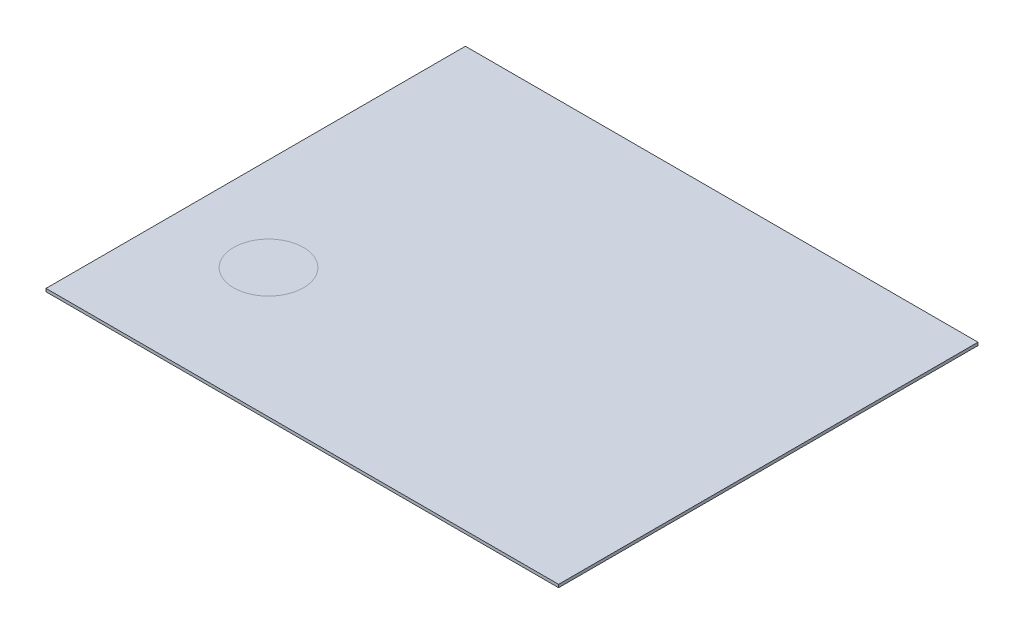
ISO-10303-21;
HEADER;
FILE_DESCRIPTION(('STEP AP214'),'2;1');
FILE_NAME('part.step','',(''),(''),'','','');
FILE_SCHEMA(('AUTOMOTIVE_DESIGN { 1 0 10303 214 1 1 1 1 }'));
ENDSEC;
DATA;
#1=APPLICATION_CONTEXT('core data for automotive mechanical design processes');
#2=APPLICATION_PROTOCOL_DEFINITION('international standard','automotive_design',2000,#1);
#3=PRODUCT_CONTEXT('',#1,'mechanical');
#4=PRODUCT('Part','Part','',(#3));
#5=PRODUCT_RELATED_PRODUCT_CATEGORY('part','',(#4));
#6=PRODUCT_DEFINITION_FORMATION('','',#4);
#7=PRODUCT_DEFINITION_CONTEXT('part definition',#1,'design');
#8=PRODUCT_DEFINITION('design','',#6,#7);
#9=PRODUCT_DEFINITION_SHAPE('','',#8);
#10=(LENGTH_UNIT() NAMED_UNIT(*) SI_UNIT(.MILLI.,.METRE.));
#11=(NAMED_UNIT(*) PLANE_ANGLE_UNIT() SI_UNIT($,.RADIAN.));
#12=(NAMED_UNIT(*) SI_UNIT($,.STERADIAN.) SOLID_ANGLE_UNIT());
#13=UNCERTAINTY_MEASURE_WITH_UNIT(LENGTH_MEASURE(1.E-05),#10,'distance_accuracy_value','');
#14=(GEOMETRIC_REPRESENTATION_CONTEXT(3) GLOBAL_UNCERTAINTY_ASSIGNED_CONTEXT((#13)) GLOBAL_UNIT_ASSIGNED_CONTEXT((#10,
#11,#12)) REPRESENTATION_CONTEXT('',''));
#15=CARTESIAN_POINT('',(0.,0.,0.));
#16=DIRECTION('',(0.,0.,1.));
#17=DIRECTION('',(1.,0.,0.));
#18=AXIS2_PLACEMENT_3D('',#15,#16,#17);
#19=CARTESIAN_POINT('',(0.,6.35,0.));
#20=DIRECTION('',(0.,1.,0.));
#21=DIRECTION('',(0.,0.,1.));
#22=AXIS2_PLACEMENT_3D('',#19,#20,#21);
#23=PLANE('',#22);
#24=DIRECTION('',(0.,0.,1.));
#25=VECTOR('',#24,1.);
#26=CARTESIAN_POINT('',(-550.,6.35,450.));
#27=LINE('',#26,#25);
#28=CARTESIAN_POINT('',(-550.,6.35,-450.));
#29=VERTEX_POINT('',#28);
#30=CARTESIAN_POINT('',(-550.,6.35,450.));
#31=VERTEX_POINT('',#30);
#32=EDGE_CURVE('E101',#29,#31,#27,.T.);
#33=ORIENTED_EDGE('',*,*,#32,.T.);
#34=DIRECTION('',(1.,0.,0.));
#35=VECTOR('',#34,1.);
#36=CARTESIAN_POINT('',(550.,6.35,450.));
#37=LINE('',#36,#35);
#38=CARTESIAN_POINT('',(550.,6.35,450.));
#39=VERTEX_POINT('',#38);
#40=EDGE_CURVE('E96',#31,#39,#37,.T.);
#41=ORIENTED_EDGE('',*,*,#40,.T.);
#42=DIRECTION('',(0.,0.,-1.));
#43=VECTOR('',#42,1.);
#44=CARTESIAN_POINT('',(550.,6.35,450.));
#45=LINE('',#44,#43);
#46=CARTESIAN_POINT('',(550.,6.35,-450.));
#47=VERTEX_POINT('',#46);
#48=EDGE_CURVE('E99',#39,#47,#45,.T.);
#49=ORIENTED_EDGE('',*,*,#48,.T.);
#50=DIRECTION('',(-1.,0.,0.));
#51=VECTOR('',#50,1.);
#52=CARTESIAN_POINT('',(550.,6.35,-450.));
#53=LINE('',#52,#51);
#54=EDGE_CURVE('E65',#47,#29,#53,.T.);
#55=ORIENTED_EDGE('',*,*,#54,.T.);
#56=EDGE_LOOP('',(#33,#41,#49,#55));
#57=FACE_BOUND('',#56,.T.);
#58=CARTESIAN_POINT('',(-349.854468767404,6.35,172.6));
#59=DIRECTION('',(0.,1.,0.));
#60=DIRECTION('',(0.,0.,1.));
#61=AXIS2_PLACEMENT_3D('',#58,#59,#60);
#62=CIRCLE('',#61,75.);
#63=CARTESIAN_POINT('',(-349.854468767404,6.35,247.6));
#64=VERTEX_POINT('',#63);
#65=EDGE_CURVE('E11',#64,#64,#62,.F.);
#66=ORIENTED_EDGE('',*,*,#65,.T.);
#67=EDGE_LOOP('',(#66));
#68=FACE_BOUND('',#67,.T.);
#69=ADVANCED_FACE('F47',(#57,#68),#23,.T.);
#70=CARTESIAN_POINT('',(-550.,6.35,450.));
#71=DIRECTION('',(1.,0.,0.));
#72=DIRECTION('',(0.,0.,-1.));
#73=AXIS2_PLACEMENT_3D('',#70,#71,#72);
#74=PLANE('',#73);
#75=DIRECTION('',(0.,0.,1.));
#76=VECTOR('',#75,1.);
#77=CARTESIAN_POINT('',(-550.,0.,450.));
#78=LINE('',#77,#76);
#79=CARTESIAN_POINT('',(-550.,0.,-450.));
#80=VERTEX_POINT('',#79);
#81=CARTESIAN_POINT('',(-550.,0.,450.));
#82=VERTEX_POINT('',#81);
#83=EDGE_CURVE('E119',#80,#82,#78,.T.);
#84=ORIENTED_EDGE('',*,*,#83,.T.);
#85=DIRECTION('',(0.,-1.,0.));
#86=VECTOR('',#85,1.);
#87=CARTESIAN_POINT('',(-550.,6.35,450.));
#88=LINE('',#87,#86);
#89=EDGE_CURVE('E57',#31,#82,#88,.T.);
#90=ORIENTED_EDGE('',*,*,#89,.F.);
#91=ORIENTED_EDGE('',*,*,#32,.F.);
#92=DIRECTION('',(0.,-1.,0.));
#93=VECTOR('',#92,1.);
#94=CARTESIAN_POINT('',(-550.,6.35,-450.));
#95=LINE('',#94,#93);
#96=EDGE_CURVE('E115',#29,#80,#95,.T.);
#97=ORIENTED_EDGE('',*,*,#96,.T.);
#98=EDGE_LOOP('',(#84,#90,#91,#97));
#99=FACE_BOUND('',#98,.T.);
#100=ADVANCED_FACE('F49',(#99),#74,.F.);
#101=CARTESIAN_POINT('',(550.,6.35,450.));
#102=DIRECTION('',(0.,0.,-1.));
#103=DIRECTION('',(-1.,0.,0.));
#104=AXIS2_PLACEMENT_3D('',#101,#102,#103);
#105=PLANE('',#104);
#106=DIRECTION('',(1.,0.,0.));
#107=VECTOR('',#106,1.);
#108=CARTESIAN_POINT('',(550.,0.,450.));
#109=LINE('',#108,#107);
#110=CARTESIAN_POINT('',(550.,0.,450.));
#111=VERTEX_POINT('',#110);
#112=EDGE_CURVE('E107',#82,#111,#109,.T.);
#113=ORIENTED_EDGE('',*,*,#112,.T.);
#114=DIRECTION('',(0.,-1.,0.));
#115=VECTOR('',#114,1.);
#116=CARTESIAN_POINT('',(550.,6.35,450.));
#117=LINE('',#116,#115);
#118=EDGE_CURVE('E105',#39,#111,#117,.T.);
#119=ORIENTED_EDGE('',*,*,#118,.F.);
#120=ORIENTED_EDGE('',*,*,#40,.F.);
#121=ORIENTED_EDGE('',*,*,#89,.T.);
#122=EDGE_LOOP('',(#113,#119,#120,#121));
#123=FACE_BOUND('',#122,.T.);
#124=ADVANCED_FACE('F106',(#123),#105,.F.);
#125=CARTESIAN_POINT('',(550.,6.35,450.));
#126=DIRECTION('',(-1.,0.,0.));
#127=DIRECTION('',(0.,0.,1.));
#128=AXIS2_PLACEMENT_3D('',#125,#126,#127);
#129=PLANE('',#128);
#130=DIRECTION('',(0.,0.,-1.));
#131=VECTOR('',#130,1.);
#132=CARTESIAN_POINT('',(550.,0.,450.));
#133=LINE('',#132,#131);
#134=CARTESIAN_POINT('',(550.,0.,-450.));
#135=VERTEX_POINT('',#134);
#136=EDGE_CURVE('E82',#111,#135,#133,.T.);
#137=ORIENTED_EDGE('',*,*,#136,.T.);
#138=DIRECTION('',(0.,-1.,0.));
#139=VECTOR('',#138,1.);
#140=CARTESIAN_POINT('',(550.,6.35,-450.));
#141=LINE('',#140,#139);
#142=EDGE_CURVE('E109',#47,#135,#141,.T.);
#143=ORIENTED_EDGE('',*,*,#142,.F.);
#144=ORIENTED_EDGE('',*,*,#48,.F.);
#145=ORIENTED_EDGE('',*,*,#118,.T.);
#146=EDGE_LOOP('',(#137,#143,#144,#145));
#147=FACE_BOUND('',#146,.T.);
#148=ADVANCED_FACE('F111',(#147),#129,.F.);
#149=CARTESIAN_POINT('',(550.,6.35,-450.));
#150=DIRECTION('',(0.,0.,1.));
#151=DIRECTION('',(1.,0.,0.));
#152=AXIS2_PLACEMENT_3D('',#149,#150,#151);
#153=PLANE('',#152);
#154=DIRECTION('',(-1.,0.,0.));
#155=VECTOR('',#154,1.);
#156=CARTESIAN_POINT('',(550.,0.,-450.));
#157=LINE('',#156,#155);
#158=EDGE_CURVE('E88',#135,#80,#157,.T.);
#159=ORIENTED_EDGE('',*,*,#158,.T.);
#160=ORIENTED_EDGE('',*,*,#96,.F.);
#161=ORIENTED_EDGE('',*,*,#54,.F.);
#162=ORIENTED_EDGE('',*,*,#142,.T.);
#163=EDGE_LOOP('',(#159,#160,#161,#162));
#164=FACE_BOUND('',#163,.T.);
#165=ADVANCED_FACE('F143',(#164),#153,.F.);
#166=ORIENTED_EDGE('',*,*,#65,.F.);
#167=EDGE_LOOP('',(#166));
#168=FACE_BOUND('',#167,.T.);
#169=ADVANCED_FACE('F138',(#168),#23,.T.);
#170=CARTESIAN_POINT('',(0.,0.,0.));
#171=DIRECTION('',(0.,1.,0.));
#172=DIRECTION('',(0.,0.,1.));
#173=AXIS2_PLACEMENT_3D('',#170,#171,#172);
#174=PLANE('',#173);
#175=ORIENTED_EDGE('',*,*,#83,.F.);
#176=ORIENTED_EDGE('',*,*,#158,.F.);
#177=ORIENTED_EDGE('',*,*,#136,.F.);
#178=ORIENTED_EDGE('',*,*,#112,.F.);
#179=EDGE_LOOP('',(#175,#176,#177,#178));
#180=FACE_BOUND('',#179,.T.);
#181=ADVANCED_FACE('F136',(#180),#174,.F.);
#182=CLOSED_SHELL('',(#69,#100,#124,#148,#165,#169,#181));
#183=MANIFOLD_SOLID_BREP('B2',#182);
#184=ADVANCED_BREP_SHAPE_REPRESENTATION('',(#18,#183),#14);
#185=SHAPE_DEFINITION_REPRESENTATION(#9,#184);
ENDSEC;
END-ISO-10303-21;
